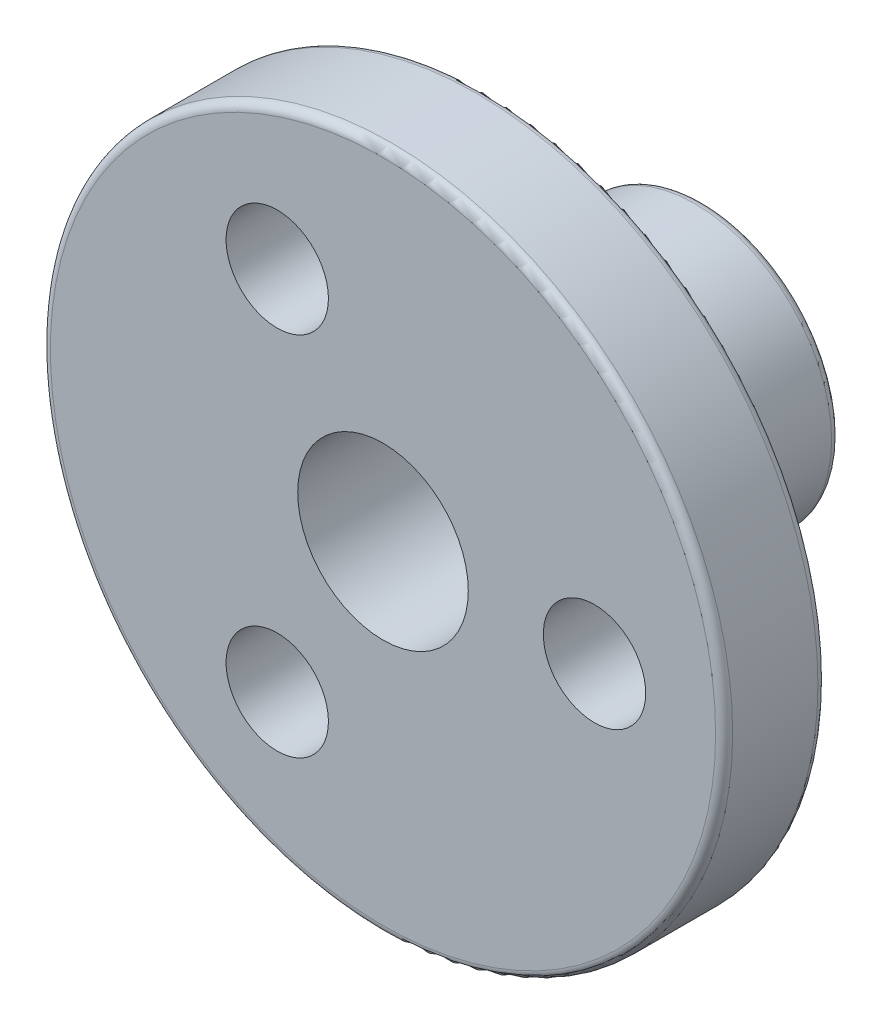
ISO-10303-21;
HEADER;
FILE_DESCRIPTION(('STEP AP214'),'2;1');
FILE_NAME('part.step','',(''),(''),'','','');
FILE_SCHEMA(('AUTOMOTIVE_DESIGN { 1 0 10303 214 1 1 1 1 }'));
ENDSEC;
DATA;
#1=APPLICATION_CONTEXT('core data for automotive mechanical design processes');
#2=APPLICATION_PROTOCOL_DEFINITION('international standard','automotive_design',2000,#1);
#3=PRODUCT_CONTEXT('',#1,'mechanical');
#4=PRODUCT('Part','Part','',(#3));
#5=PRODUCT_RELATED_PRODUCT_CATEGORY('part','',(#4));
#6=PRODUCT_DEFINITION_FORMATION('','',#4);
#7=PRODUCT_DEFINITION_CONTEXT('part definition',#1,'design');
#8=PRODUCT_DEFINITION('design','',#6,#7);
#9=PRODUCT_DEFINITION_SHAPE('','',#8);
#10=(LENGTH_UNIT() NAMED_UNIT(*) SI_UNIT(.MILLI.,.METRE.));
#11=(NAMED_UNIT(*) PLANE_ANGLE_UNIT() SI_UNIT($,.RADIAN.));
#12=(NAMED_UNIT(*) SI_UNIT($,.STERADIAN.) SOLID_ANGLE_UNIT());
#13=UNCERTAINTY_MEASURE_WITH_UNIT(LENGTH_MEASURE(1.E-05),#10,'distance_accuracy_value','');
#14=(GEOMETRIC_REPRESENTATION_CONTEXT(3) GLOBAL_UNCERTAINTY_ASSIGNED_CONTEXT((#13)) GLOBAL_UNIT_ASSIGNED_CONTEXT((#10,
#11,#12)) REPRESENTATION_CONTEXT('',''));
#15=CARTESIAN_POINT('',(0.,0.,0.));
#16=DIRECTION('',(0.,0.,1.));
#17=DIRECTION('',(1.,0.,0.));
#18=AXIS2_PLACEMENT_3D('',#15,#16,#17);
#19=CARTESIAN_POINT('',(0.,0.,3.));
#20=DIRECTION('',(0.,0.,1.));
#21=DIRECTION('',(1.,0.,0.));
#22=AXIS2_PLACEMENT_3D('',#19,#20,#21);
#23=PLANE('',#22);
#24=CARTESIAN_POINT('',(0.,0.,3.));
#25=DIRECTION('',(0.,0.,1.));
#26=DIRECTION('',(1.,0.,0.));
#27=AXIS2_PLACEMENT_3D('',#24,#25,#26);
#28=CIRCLE('',#27,9.75);
#29=CARTESIAN_POINT('',(9.75,0.,3.));
#30=VERTEX_POINT('',#29);
#31=EDGE_CURVE('E10',#30,#30,#28,.T.);
#32=ORIENTED_EDGE('',*,*,#31,.T.);
#33=EDGE_LOOP('',(#32));
#34=FACE_BOUND('',#33,.T.);
#35=CARTESIAN_POINT('',(-3.1,-5.36935750346352,3.));
#36=DIRECTION('',(0.,0.,1.));
#37=DIRECTION('',(1.,0.,0.));
#38=AXIS2_PLACEMENT_3D('',#35,#36,#37);
#39=CIRCLE('',#38,1.5);
#40=CARTESIAN_POINT('',(-1.6,-5.36935750346352,3.));
#41=VERTEX_POINT('',#40);
#42=EDGE_CURVE('E76',#41,#41,#39,.T.);
#43=ORIENTED_EDGE('',*,*,#42,.F.);
#44=EDGE_LOOP('',(#43));
#45=FACE_BOUND('',#44,.T.);
#46=CARTESIAN_POINT('',(0.,0.,3.));
#47=DIRECTION('',(0.,0.,1.));
#48=DIRECTION('',(1.,0.,0.));
#49=AXIS2_PLACEMENT_3D('',#46,#47,#48);
#50=CIRCLE('',#49,2.5);
#51=CARTESIAN_POINT('',(2.5,0.,3.));
#52=VERTEX_POINT('',#51);
#53=EDGE_CURVE('E69',#52,#52,#50,.T.);
#54=ORIENTED_EDGE('',*,*,#53,.F.);
#55=EDGE_LOOP('',(#54));
#56=FACE_BOUND('',#55,.T.);
#57=CARTESIAN_POINT('',(6.2,0.,3.));
#58=DIRECTION('',(0.,0.,1.));
#59=DIRECTION('',(1.,0.,0.));
#60=AXIS2_PLACEMENT_3D('',#57,#58,#59);
#61=CIRCLE('',#60,1.5);
#62=CARTESIAN_POINT('',(7.7,0.,3.));
#63=VERTEX_POINT('',#62);
#64=EDGE_CURVE('E72',#63,#63,#61,.T.);
#65=ORIENTED_EDGE('',*,*,#64,.F.);
#66=EDGE_LOOP('',(#65));
#67=FACE_BOUND('',#66,.T.);
#68=CARTESIAN_POINT('',(-3.1,5.36935750346352,3.));
#69=DIRECTION('',(0.,0.,1.));
#70=DIRECTION('',(1.,0.,0.));
#71=AXIS2_PLACEMENT_3D('',#68,#69,#70);
#72=CIRCLE('',#71,1.5);
#73=CARTESIAN_POINT('',(-1.6,5.36935750346352,3.));
#74=VERTEX_POINT('',#73);
#75=EDGE_CURVE('E82',#74,#74,#72,.T.);
#76=ORIENTED_EDGE('',*,*,#75,.F.);
#77=EDGE_LOOP('',(#76));
#78=FACE_BOUND('',#77,.T.);
#79=ADVANCED_FACE('F37',(#34,#45,#56,#67,#78),#23,.T.);
#80=CARTESIAN_POINT('',(0.,0.,0.));
#81=DIRECTION('',(0.,0.,1.));
#82=DIRECTION('',(1.,0.,0.));
#83=AXIS2_PLACEMENT_3D('',#80,#81,#82);
#84=PLANE('',#83);
#85=CARTESIAN_POINT('',(0.,0.,0.));
#86=DIRECTION('',(0.,0.,1.));
#87=DIRECTION('',(1.,0.,0.));
#88=AXIS2_PLACEMENT_3D('',#85,#86,#87);
#89=CIRCLE('',#88,9.75);
#90=CARTESIAN_POINT('',(9.75,0.,0.));
#91=VERTEX_POINT('',#90);
#92=EDGE_CURVE('E44',#91,#91,#89,.F.);
#93=ORIENTED_EDGE('',*,*,#92,.T.);
#94=EDGE_LOOP('',(#93));
#95=FACE_BOUND('',#94,.T.);
#96=CARTESIAN_POINT('',(0.,0.,0.));
#97=DIRECTION('',(0.,0.,1.));
#98=DIRECTION('',(1.,0.,0.));
#99=AXIS2_PLACEMENT_3D('',#96,#97,#98);
#100=CIRCLE('',#99,4.25);
#101=CARTESIAN_POINT('',(4.25,0.,0.));
#102=VERTEX_POINT('',#101);
#103=EDGE_CURVE('E63',#102,#102,#100,.T.);
#104=ORIENTED_EDGE('',*,*,#103,.T.);
#105=EDGE_LOOP('',(#104));
#106=FACE_BOUND('',#105,.T.);
#107=CARTESIAN_POINT('',(6.2,0.,0.));
#108=DIRECTION('',(0.,0.,1.));
#109=DIRECTION('',(1.,0.,0.));
#110=AXIS2_PLACEMENT_3D('',#107,#108,#109);
#111=CIRCLE('',#110,1.5);
#112=CARTESIAN_POINT('',(7.7,0.,0.));
#113=VERTEX_POINT('',#112);
#114=EDGE_CURVE('E73',#113,#113,#111,.T.);
#115=ORIENTED_EDGE('',*,*,#114,.T.);
#116=EDGE_LOOP('',(#115));
#117=FACE_BOUND('',#116,.T.);
#118=CARTESIAN_POINT('',(-3.1,-5.36935750346352,0.));
#119=DIRECTION('',(0.,0.,1.));
#120=DIRECTION('',(1.,0.,0.));
#121=AXIS2_PLACEMENT_3D('',#118,#119,#120);
#122=CIRCLE('',#121,1.5);
#123=CARTESIAN_POINT('',(-1.6,-5.36935750346352,0.));
#124=VERTEX_POINT('',#123);
#125=EDGE_CURVE('E79',#124,#124,#122,.T.);
#126=ORIENTED_EDGE('',*,*,#125,.T.);
#127=EDGE_LOOP('',(#126));
#128=FACE_BOUND('',#127,.T.);
#129=CARTESIAN_POINT('',(-3.1,5.36935750346352,0.));
#130=DIRECTION('',(0.,0.,1.));
#131=DIRECTION('',(1.,0.,0.));
#132=AXIS2_PLACEMENT_3D('',#129,#130,#131);
#133=CIRCLE('',#132,1.5);
#134=CARTESIAN_POINT('',(-1.6,5.36935750346352,0.));
#135=VERTEX_POINT('',#134);
#136=EDGE_CURVE('E85',#135,#135,#133,.T.);
#137=ORIENTED_EDGE('',*,*,#136,.T.);
#138=EDGE_LOOP('',(#137));
#139=FACE_BOUND('',#138,.T.);
#140=ADVANCED_FACE('F109',(#95,#106,#117,#128,#139),#84,.F.);
#141=CARTESIAN_POINT('',(0.,0.,3.));
#142=DIRECTION('',(0.,0.,-1.));
#143=DIRECTION('',(-1.,0.,0.));
#144=AXIS2_PLACEMENT_3D('',#141,#142,#143);
#145=CYLINDRICAL_SURFACE('',#144,10.);
#146=CARTESIAN_POINT('',(0.,0.,0.25));
#147=DIRECTION('',(0.,0.,1.));
#148=DIRECTION('',(1.,0.,0.));
#149=AXIS2_PLACEMENT_3D('',#146,#147,#148);
#150=CIRCLE('',#149,10.);
#151=CARTESIAN_POINT('',(10.,0.,0.25));
#152=VERTEX_POINT('',#151);
#153=EDGE_CURVE('E48',#152,#152,#150,.T.);
#154=ORIENTED_EDGE('',*,*,#153,.T.);
#155=EDGE_LOOP('',(#154));
#156=FACE_BOUND('',#155,.T.);
#157=CARTESIAN_POINT('',(0.,0.,2.75));
#158=DIRECTION('',(0.,0.,1.));
#159=DIRECTION('',(1.,0.,0.));
#160=AXIS2_PLACEMENT_3D('',#157,#158,#159);
#161=CIRCLE('',#160,10.);
#162=CARTESIAN_POINT('',(10.,0.,2.75));
#163=VERTEX_POINT('',#162);
#164=EDGE_CURVE('E52',#163,#163,#161,.F.);
#165=ORIENTED_EDGE('',*,*,#164,.T.);
#166=EDGE_LOOP('',(#165));
#167=FACE_BOUND('',#166,.T.);
#168=ADVANCED_FACE('F99',(#156,#167),#145,.T.);
#169=CARTESIAN_POINT('',(0.,0.,3.));
#170=DIRECTION('',(0.,0.,-1.));
#171=DIRECTION('',(-1.,0.,0.));
#172=AXIS2_PLACEMENT_3D('',#169,#170,#171);
#173=CYLINDRICAL_SURFACE('',#172,2.5);
#174=ORIENTED_EDGE('',*,*,#53,.T.);
#175=EDGE_LOOP('',(#174));
#176=FACE_BOUND('',#175,.T.);
#177=CARTESIAN_POINT('',(0.,0.,-6.4));
#178=DIRECTION('',(0.,0.,-1.));
#179=DIRECTION('',(-1.,0.,0.));
#180=AXIS2_PLACEMENT_3D('',#177,#178,#179);
#181=CIRCLE('',#180,2.5);
#182=CARTESIAN_POINT('',(-2.5,0.,-6.4));
#183=VERTEX_POINT('',#182);
#184=EDGE_CURVE('E88',#183,#183,#181,.F.);
#185=ORIENTED_EDGE('',*,*,#184,.F.);
#186=EDGE_LOOP('',(#185));
#187=FACE_BOUND('',#186,.T.);
#188=ADVANCED_FACE('F96',(#176,#187),#173,.F.);
#189=CARTESIAN_POINT('',(6.2,0.,3.));
#190=DIRECTION('',(0.,0.,-1.));
#191=DIRECTION('',(-1.,0.,0.));
#192=AXIS2_PLACEMENT_3D('',#189,#190,#191);
#193=CYLINDRICAL_SURFACE('',#192,1.5);
#194=ORIENTED_EDGE('',*,*,#64,.T.);
#195=EDGE_LOOP('',(#194));
#196=FACE_BOUND('',#195,.T.);
#197=ORIENTED_EDGE('',*,*,#114,.F.);
#198=EDGE_LOOP('',(#197));
#199=FACE_BOUND('',#198,.T.);
#200=ADVANCED_FACE('F98',(#196,#199),#193,.F.);
#201=CARTESIAN_POINT('',(-3.1,-5.36935750346352,3.));
#202=DIRECTION('',(0.,0.,-1.));
#203=DIRECTION('',(-1.,0.,0.));
#204=AXIS2_PLACEMENT_3D('',#201,#202,#203);
#205=CYLINDRICAL_SURFACE('',#204,1.5);
#206=ORIENTED_EDGE('',*,*,#42,.T.);
#207=EDGE_LOOP('',(#206));
#208=FACE_BOUND('',#207,.T.);
#209=ORIENTED_EDGE('',*,*,#125,.F.);
#210=EDGE_LOOP('',(#209));
#211=FACE_BOUND('',#210,.T.);
#212=ADVANCED_FACE('F106',(#208,#211),#205,.F.);
#213=CARTESIAN_POINT('',(-3.1,5.36935750346352,3.));
#214=DIRECTION('',(0.,0.,-1.));
#215=DIRECTION('',(-1.,0.,0.));
#216=AXIS2_PLACEMENT_3D('',#213,#214,#215);
#217=CYLINDRICAL_SURFACE('',#216,1.5);
#218=ORIENTED_EDGE('',*,*,#75,.T.);
#219=EDGE_LOOP('',(#218));
#220=FACE_BOUND('',#219,.T.);
#221=ORIENTED_EDGE('',*,*,#136,.F.);
#222=EDGE_LOOP('',(#221));
#223=FACE_BOUND('',#222,.T.);
#224=ADVANCED_FACE('F188',(#220,#223),#217,.F.);
#225=CARTESIAN_POINT('',(0.,0.,-6.4));
#226=DIRECTION('',(0.,0.,1.));
#227=DIRECTION('',(1.,0.,0.));
#228=AXIS2_PLACEMENT_3D('',#225,#226,#227);
#229=CYLINDRICAL_SURFACE('',#228,4.);
#230=CARTESIAN_POINT('',(0.,0.,-6.15));
#231=DIRECTION('',(0.,0.,-1.));
#232=DIRECTION('',(-1.,0.,0.));
#233=AXIS2_PLACEMENT_3D('',#230,#231,#232);
#234=CIRCLE('',#233,4.);
#235=CARTESIAN_POINT('',(-4.,0.,-6.15));
#236=VERTEX_POINT('',#235);
#237=EDGE_CURVE('E57',#236,#236,#234,.F.);
#238=ORIENTED_EDGE('',*,*,#237,.T.);
#239=EDGE_LOOP('',(#238));
#240=FACE_BOUND('',#239,.T.);
#241=CARTESIAN_POINT('',(0.,0.,-0.25));
#242=DIRECTION('',(0.,0.,1.));
#243=DIRECTION('',(1.,0.,0.));
#244=AXIS2_PLACEMENT_3D('',#241,#242,#243);
#245=CIRCLE('',#244,4.);
#246=CARTESIAN_POINT('',(4.,0.,-0.25));
#247=VERTEX_POINT('',#246);
#248=EDGE_CURVE('E66',#247,#247,#245,.F.);
#249=ORIENTED_EDGE('',*,*,#248,.T.);
#250=EDGE_LOOP('',(#249));
#251=FACE_BOUND('',#250,.T.);
#252=ADVANCED_FACE('F178',(#240,#251),#229,.T.);
#253=CARTESIAN_POINT('',(0.,0.,-6.4));
#254=DIRECTION('',(0.,0.,-1.));
#255=DIRECTION('',(-1.,0.,0.));
#256=AXIS2_PLACEMENT_3D('',#253,#254,#255);
#257=PLANE('',#256);
#258=CARTESIAN_POINT('',(0.,0.,-6.4));
#259=DIRECTION('',(0.,0.,-1.));
#260=DIRECTION('',(-1.,0.,0.));
#261=AXIS2_PLACEMENT_3D('',#258,#259,#260);
#262=CIRCLE('',#261,3.75);
#263=CARTESIAN_POINT('',(-3.75,0.,-6.4));
#264=VERTEX_POINT('',#263);
#265=EDGE_CURVE('E60',#264,#264,#262,.T.);
#266=ORIENTED_EDGE('',*,*,#265,.T.);
#267=EDGE_LOOP('',(#266));
#268=FACE_BOUND('',#267,.T.);
#269=ORIENTED_EDGE('',*,*,#184,.T.);
#270=EDGE_LOOP('',(#269));
#271=FACE_BOUND('',#270,.T.);
#272=ADVANCED_FACE('F94',(#268,#271),#257,.T.);
#273=CARTESIAN_POINT('',(0.,0.,-0.25));
#274=DIRECTION('',(0.,0.,1.));
#275=DIRECTION('',(1.,0.,0.));
#276=AXIS2_PLACEMENT_3D('',#273,#274,#275);
#277=TOROIDAL_SURFACE('',#276,4.25,0.25);
#278=ORIENTED_EDGE('',*,*,#103,.F.);
#279=EDGE_LOOP('',(#278));
#280=FACE_BOUND('',#279,.T.);
#281=ORIENTED_EDGE('',*,*,#248,.F.);
#282=EDGE_LOOP('',(#281));
#283=FACE_BOUND('',#282,.T.);
#284=ADVANCED_FACE('F120',(#280,#283),#277,.F.);
#285=CARTESIAN_POINT('',(0.,0.,-6.15));
#286=DIRECTION('',(0.,0.,-1.));
#287=DIRECTION('',(-1.,0.,0.));
#288=AXIS2_PLACEMENT_3D('',#285,#286,#287);
#289=TOROIDAL_SURFACE('',#288,3.75,0.25);
#290=ORIENTED_EDGE('',*,*,#237,.F.);
#291=EDGE_LOOP('',(#290));
#292=FACE_BOUND('',#291,.T.);
#293=ORIENTED_EDGE('',*,*,#265,.F.);
#294=EDGE_LOOP('',(#293));
#295=FACE_BOUND('',#294,.T.);
#296=ADVANCED_FACE('F123',(#292,#295),#289,.T.);
#297=CARTESIAN_POINT('',(0.,0.,0.25));
#298=DIRECTION('',(0.,0.,1.));
#299=DIRECTION('',(1.,0.,0.));
#300=AXIS2_PLACEMENT_3D('',#297,#298,#299);
#301=TOROIDAL_SURFACE('',#300,9.75,0.25);
#302=ORIENTED_EDGE('',*,*,#92,.F.);
#303=EDGE_LOOP('',(#302));
#304=FACE_BOUND('',#303,.T.);
#305=ORIENTED_EDGE('',*,*,#153,.F.);
#306=EDGE_LOOP('',(#305));
#307=FACE_BOUND('',#306,.T.);
#308=ADVANCED_FACE('F126',(#304,#307),#301,.T.);
#309=CARTESIAN_POINT('',(0.,0.,2.75));
#310=DIRECTION('',(0.,0.,1.));
#311=DIRECTION('',(1.,0.,0.));
#312=AXIS2_PLACEMENT_3D('',#309,#310,#311);
#313=TOROIDAL_SURFACE('',#312,9.75,0.25);
#314=ORIENTED_EDGE('',*,*,#164,.F.);
#315=EDGE_LOOP('',(#314));
#316=FACE_BOUND('',#315,.T.);
#317=ORIENTED_EDGE('',*,*,#31,.F.);
#318=EDGE_LOOP('',(#317));
#319=FACE_BOUND('',#318,.T.);
#320=ADVANCED_FACE('F39',(#316,#319),#313,.T.);
#321=CLOSED_SHELL('',(#79,#140,#168,#188,#200,#212,#224,#252,#272,#284,#296,#308,#320));
#322=MANIFOLD_SOLID_BREP('B2',#321);
#323=ADVANCED_BREP_SHAPE_REPRESENTATION('',(#18,#322),#14);
#324=SHAPE_DEFINITION_REPRESENTATION(#9,#323);
ENDSEC;
END-ISO-10303-21;
